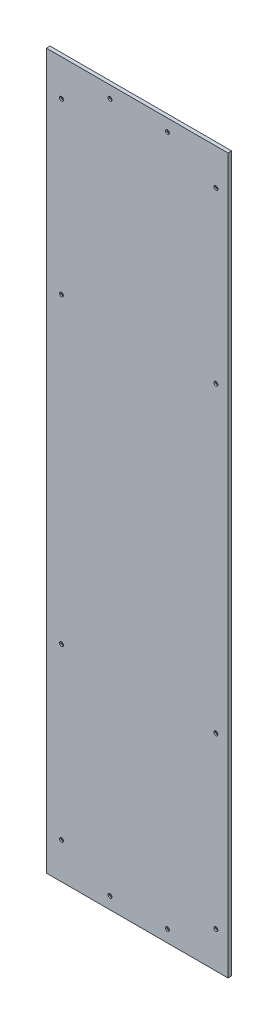
ISO-10303-21;
HEADER;
FILE_DESCRIPTION(('STEP AP214'),'2;1');
FILE_NAME('part.step','',(''),(''),'','','');
FILE_SCHEMA(('AUTOMOTIVE_DESIGN { 1 0 10303 214 1 1 1 1 }'));
ENDSEC;
DATA;
#1=APPLICATION_CONTEXT('core data for automotive mechanical design processes');
#2=APPLICATION_PROTOCOL_DEFINITION('international standard','automotive_design',2000,#1);
#3=PRODUCT_CONTEXT('',#1,'mechanical');
#4=PRODUCT('Part','Part','',(#3));
#5=PRODUCT_RELATED_PRODUCT_CATEGORY('part','',(#4));
#6=PRODUCT_DEFINITION_FORMATION('','',#4);
#7=PRODUCT_DEFINITION_CONTEXT('part definition',#1,'design');
#8=PRODUCT_DEFINITION('design','',#6,#7);
#9=PRODUCT_DEFINITION_SHAPE('','',#8);
#10=(LENGTH_UNIT() NAMED_UNIT(*) SI_UNIT(.MILLI.,.METRE.));
#11=(NAMED_UNIT(*) PLANE_ANGLE_UNIT() SI_UNIT($,.RADIAN.));
#12=(NAMED_UNIT(*) SI_UNIT($,.STERADIAN.) SOLID_ANGLE_UNIT());
#13=UNCERTAINTY_MEASURE_WITH_UNIT(LENGTH_MEASURE(1.E-05),#10,'distance_accuracy_value','');
#14=(GEOMETRIC_REPRESENTATION_CONTEXT(3) GLOBAL_UNCERTAINTY_ASSIGNED_CONTEXT((#13)) GLOBAL_UNIT_ASSIGNED_CONTEXT((#10,
#11,#12)) REPRESENTATION_CONTEXT('',''));
#15=CARTESIAN_POINT('',(0.,0.,0.));
#16=DIRECTION('',(0.,0.,1.));
#17=DIRECTION('',(1.,0.,0.));
#18=AXIS2_PLACEMENT_3D('',#15,#16,#17);
#19=CARTESIAN_POINT('',(0.,0.,-3.));
#20=DIRECTION('',(0.,0.,1.));
#21=DIRECTION('',(1.,0.,0.));
#22=AXIS2_PLACEMENT_3D('',#19,#20,#21);
#23=PLANE('',#22);
#24=CARTESIAN_POINT('',(105.,1160.,-2.9999999999859));
#25=DIRECTION('',(0.,0.,-1.));
#26=DIRECTION('',(-1.,0.,0.));
#27=AXIS2_PLACEMENT_3D('',#24,#25,#26);
#28=CIRCLE('',#27,6.85499999995499);
#29=CARTESIAN_POINT('',(98.145000000045,1160.,-2.9999999999859));
#30=VERTEX_POINT('',#29);
#31=EDGE_CURVE('E69',#30,#30,#28,.F.);
#32=ORIENTED_EDGE('',*,*,#31,.T.);
#33=EDGE_LOOP('',(#32));
#34=FACE_BOUND('',#33,.T.);
#35=CARTESIAN_POINT('',(200.,1160.,-3.00000000004275));
#36=DIRECTION('',(0.,0.,-1.));
#37=DIRECTION('',(0.,1.,0.));
#38=AXIS2_PLACEMENT_3D('',#35,#36,#37);
#39=CIRCLE('',#38,6.85500000004141);
#40=CARTESIAN_POINT('',(200.,1166.85500000004,-3.00000000004275));
#41=VERTEX_POINT('',#40);
#42=EDGE_CURVE('E117',#41,#41,#39,.F.);
#43=ORIENTED_EDGE('',*,*,#42,.T.);
#44=EDGE_LOOP('',(#43));
#45=FACE_BOUND('',#44,.T.);
#46=CARTESIAN_POINT('',(25.,1120.,-2.9999999999859));
#47=DIRECTION('',(0.,0.,-1.));
#48=DIRECTION('',(-1.,0.,0.));
#49=AXIS2_PLACEMENT_3D('',#46,#47,#48);
#50=CIRCLE('',#49,6.85499999993908);
#51=CARTESIAN_POINT('',(18.1450000000609,1120.,-2.9999999999859));
#52=VERTEX_POINT('',#51);
#53=EDGE_CURVE('E120',#52,#52,#50,.F.);
#54=ORIENTED_EDGE('',*,*,#53,.T.);
#55=EDGE_LOOP('',(#54));
#56=FACE_BOUND('',#55,.T.);
#57=CARTESIAN_POINT('',(25.,60.,-2.9999999999859));
#58=DIRECTION('',(0.,0.,-1.));
#59=DIRECTION('',(-1.,0.,0.));
#60=AXIS2_PLACEMENT_3D('',#57,#58,#59);
#61=CIRCLE('',#60,6.85499999993908);
#62=CARTESIAN_POINT('',(18.1450000000609,60.,-2.9999999999859));
#63=VERTEX_POINT('',#62);
#64=EDGE_CURVE('E123',#63,#63,#61,.F.);
#65=ORIENTED_EDGE('',*,*,#64,.T.);
#66=EDGE_LOOP('',(#65));
#67=FACE_BOUND('',#66,.T.);
#68=CARTESIAN_POINT('',(25.,840.,-2.9999999999859));
#69=DIRECTION('',(0.,0.,-1.));
#70=DIRECTION('',(-1.,0.,0.));
#71=AXIS2_PLACEMENT_3D('',#68,#69,#70);
#72=CIRCLE('',#71,6.85499999993908);
#73=CARTESIAN_POINT('',(18.1450000000609,840.,-2.9999999999859));
#74=VERTEX_POINT('',#73);
#75=EDGE_CURVE('E126',#74,#74,#72,.F.);
#76=ORIENTED_EDGE('',*,*,#75,.T.);
#77=EDGE_LOOP('',(#76));
#78=FACE_BOUND('',#77,.T.);
#79=CARTESIAN_POINT('',(25.,340.,-2.9999999999859));
#80=DIRECTION('',(0.,0.,-1.));
#81=DIRECTION('',(-1.,0.,0.));
#82=AXIS2_PLACEMENT_3D('',#79,#80,#81);
#83=CIRCLE('',#82,6.85499999993908);
#84=CARTESIAN_POINT('',(18.1450000000609,340.,-2.9999999999859));
#85=VERTEX_POINT('',#84);
#86=EDGE_CURVE('E129',#85,#85,#83,.F.);
#87=ORIENTED_EDGE('',*,*,#86,.T.);
#88=EDGE_LOOP('',(#87));
#89=FACE_BOUND('',#88,.T.);
#90=CARTESIAN_POINT('',(280.,1120.,-2.9999999999859));
#91=DIRECTION('',(0.,0.,-1.));
#92=DIRECTION('',(0.,1.,0.));
#93=AXIS2_PLACEMENT_3D('',#90,#91,#92);
#94=CIRCLE('',#93,6.85500000005734);
#95=CARTESIAN_POINT('',(280.,1126.85500000006,-2.9999999999859));
#96=VERTEX_POINT('',#95);
#97=EDGE_CURVE('E132',#96,#96,#94,.F.);
#98=ORIENTED_EDGE('',*,*,#97,.T.);
#99=EDGE_LOOP('',(#98));
#100=FACE_BOUND('',#99,.T.);
#101=CARTESIAN_POINT('',(280.,60.,-2.9999999999859));
#102=DIRECTION('',(0.,0.,-1.));
#103=DIRECTION('',(0.,1.,0.));
#104=AXIS2_PLACEMENT_3D('',#101,#102,#103);
#105=CIRCLE('',#104,6.85500000005734);
#106=CARTESIAN_POINT('',(280.,66.8550000000573,-2.9999999999859));
#107=VERTEX_POINT('',#106);
#108=EDGE_CURVE('E135',#107,#107,#105,.F.);
#109=ORIENTED_EDGE('',*,*,#108,.T.);
#110=EDGE_LOOP('',(#109));
#111=FACE_BOUND('',#110,.T.);
#112=CARTESIAN_POINT('',(280.,840.,-2.9999999999859));
#113=DIRECTION('',(0.,0.,-1.));
#114=DIRECTION('',(0.,1.,0.));
#115=AXIS2_PLACEMENT_3D('',#112,#113,#114);
#116=CIRCLE('',#115,6.85500000005734);
#117=CARTESIAN_POINT('',(280.,846.855000000057,-2.9999999999859));
#118=VERTEX_POINT('',#117);
#119=EDGE_CURVE('E138',#118,#118,#116,.F.);
#120=ORIENTED_EDGE('',*,*,#119,.T.);
#121=EDGE_LOOP('',(#120));
#122=FACE_BOUND('',#121,.T.);
#123=CARTESIAN_POINT('',(280.,340.,-2.9999999999859));
#124=DIRECTION('',(0.,0.,-1.));
#125=DIRECTION('',(0.,1.,0.));
#126=AXIS2_PLACEMENT_3D('',#123,#124,#125);
#127=CIRCLE('',#126,6.85500000005734);
#128=CARTESIAN_POINT('',(280.,346.855000000057,-2.9999999999859));
#129=VERTEX_POINT('',#128);
#130=EDGE_CURVE('E141',#129,#129,#127,.F.);
#131=ORIENTED_EDGE('',*,*,#130,.T.);
#132=EDGE_LOOP('',(#131));
#133=FACE_BOUND('',#132,.T.);
#134=CARTESIAN_POINT('',(105.,20.,-2.9999999999859));
#135=DIRECTION('',(0.,0.,-1.));
#136=DIRECTION('',(-1.,0.,0.));
#137=AXIS2_PLACEMENT_3D('',#134,#135,#136);
#138=CIRCLE('',#137,6.85499999995499);
#139=CARTESIAN_POINT('',(98.145000000045,20.,-2.9999999999859));
#140=VERTEX_POINT('',#139);
#141=EDGE_CURVE('E143',#140,#140,#138,.F.);
#142=ORIENTED_EDGE('',*,*,#141,.T.);
#143=EDGE_LOOP('',(#142));
#144=FACE_BOUND('',#143,.T.);
#145=CARTESIAN_POINT('',(200.,20.,-3.00000000004275));
#146=DIRECTION('',(0.,0.,-1.));
#147=DIRECTION('',(0.,1.,0.));
#148=AXIS2_PLACEMENT_3D('',#145,#146,#147);
#149=CIRCLE('',#148,6.85500000004141);
#150=CARTESIAN_POINT('',(200.,26.8550000000414,-3.00000000004275));
#151=VERTEX_POINT('',#150);
#152=EDGE_CURVE('E20',#151,#151,#149,.F.);
#153=ORIENTED_EDGE('',*,*,#152,.T.);
#154=EDGE_LOOP('',(#153));
#155=FACE_BOUND('',#154,.T.);
#156=DIRECTION('',(1.,0.,0.));
#157=VECTOR('',#156,1.);
#158=CARTESIAN_POINT('',(300.,1180.,-3.));
#159=LINE('',#158,#157);
#160=CARTESIAN_POINT('',(300.,1180.,-3.));
#161=VERTEX_POINT('',#160);
#162=CARTESIAN_POINT('',(0.,1180.,-3.));
#163=VERTEX_POINT('',#162);
#164=EDGE_CURVE('E160',#161,#163,#159,.F.);
#165=ORIENTED_EDGE('',*,*,#164,.F.);
#166=DIRECTION('',(0.,1.,0.));
#167=VECTOR('',#166,1.);
#168=CARTESIAN_POINT('',(300.,0.,-3.));
#169=LINE('',#168,#167);
#170=CARTESIAN_POINT('',(300.,0.,-3.));
#171=VERTEX_POINT('',#170);
#172=EDGE_CURVE('E71',#171,#161,#169,.T.);
#173=ORIENTED_EDGE('',*,*,#172,.F.);
#174=DIRECTION('',(1.,0.,0.));
#175=VECTOR('',#174,1.);
#176=CARTESIAN_POINT('',(0.,0.,-3.));
#177=LINE('',#176,#175);
#178=CARTESIAN_POINT('',(0.,0.,-3.));
#179=VERTEX_POINT('',#178);
#180=EDGE_CURVE('E55',#179,#171,#177,.T.);
#181=ORIENTED_EDGE('',*,*,#180,.F.);
#182=DIRECTION('',(0.,1.,0.));
#183=VECTOR('',#182,1.);
#184=CARTESIAN_POINT('',(0.,1180.,-3.));
#185=LINE('',#184,#183);
#186=EDGE_CURVE('E60',#163,#179,#185,.F.);
#187=ORIENTED_EDGE('',*,*,#186,.F.);
#188=EDGE_LOOP('',(#165,#173,#181,#187));
#189=FACE_BOUND('',#188,.T.);
#190=ADVANCED_FACE('F17',(#34,#45,#56,#67,#78,#89,#100,#111,#122,#133,#144,#155,#189),#23,.F.);
#191=CARTESIAN_POINT('',(200.,20.,-3.00000000004275));
#192=DIRECTION('',(0.,0.,-1.));
#193=DIRECTION('',(0.,1.,0.));
#194=AXIS2_PLACEMENT_3D('',#191,#192,#193);
#195=CONICAL_SURFACE('',#194,6.85500000004141,0.785397999990634);
#196=ORIENTED_EDGE('',*,*,#152,.F.);
#197=EDGE_LOOP('',(#196));
#198=FACE_BOUND('',#197,.T.);
#199=CARTESIAN_POINT('',(200.,20.,0.555001161756055));
#200=DIRECTION('',(0.,0.,-1.));
#201=DIRECTION('',(-1.,0.,0.));
#202=AXIS2_PLACEMENT_3D('',#199,#200,#201);
#203=CIRCLE('',#202,3.3);
#204=CARTESIAN_POINT('',(196.7,20.,0.555001161756055));
#205=VERTEX_POINT('',#204);
#206=EDGE_CURVE('E157',#205,#205,#203,.F.);
#207=ORIENTED_EDGE('',*,*,#206,.T.);
#208=EDGE_LOOP('',(#207));
#209=FACE_BOUND('',#208,.T.);
#210=ADVANCED_FACE('F151',(#198,#209),#195,.F.);
#211=CARTESIAN_POINT('',(105.,20.,-2.99999999992906));
#212=DIRECTION('',(0.,0.,-1.));
#213=DIRECTION('',(-1.,0.,0.));
#214=AXIS2_PLACEMENT_3D('',#211,#212,#213);
#215=CONICAL_SURFACE('',#214,6.85499999989815,0.785397999990634);
#216=ORIENTED_EDGE('',*,*,#141,.F.);
#217=EDGE_LOOP('',(#216));
#218=FACE_BOUND('',#217,.T.);
#219=CARTESIAN_POINT('',(105.,20.,0.555001161756055));
#220=DIRECTION('',(0.,0.,-1.));
#221=DIRECTION('',(-1.,0.,0.));
#222=AXIS2_PLACEMENT_3D('',#219,#220,#221);
#223=CIRCLE('',#222,3.29999999999998);
#224=CARTESIAN_POINT('',(101.7,20.,0.555001161756055));
#225=VERTEX_POINT('',#224);
#226=EDGE_CURVE('E159',#225,#225,#223,.F.);
#227=ORIENTED_EDGE('',*,*,#226,.T.);
#228=EDGE_LOOP('',(#227));
#229=FACE_BOUND('',#228,.T.);
#230=ADVANCED_FACE('F154',(#218,#229),#215,.F.);
#231=CARTESIAN_POINT('',(280.,340.,-2.99999999987222));
#232=DIRECTION('',(0.,0.,-1.));
#233=DIRECTION('',(0.,1.,0.));
#234=AXIS2_PLACEMENT_3D('',#231,#232,#233);
#235=CONICAL_SURFACE('',#234,6.85499999994366,0.785398000006624);
#236=ORIENTED_EDGE('',*,*,#130,.F.);
#237=EDGE_LOOP('',(#236));
#238=FACE_BOUND('',#237,.T.);
#239=CARTESIAN_POINT('',(280.,340.,0.555001161756055));
#240=DIRECTION('',(0.,0.,-1.));
#241=DIRECTION('',(-1.,0.,0.));
#242=AXIS2_PLACEMENT_3D('',#239,#240,#241);
#243=CIRCLE('',#242,3.29999999999997);
#244=CARTESIAN_POINT('',(276.7,340.,0.555001161756055));
#245=VERTEX_POINT('',#244);
#246=EDGE_CURVE('E163',#245,#245,#243,.F.);
#247=ORIENTED_EDGE('',*,*,#246,.T.);
#248=EDGE_LOOP('',(#247));
#249=FACE_BOUND('',#248,.T.);
#250=ADVANCED_FACE('F235',(#238,#249),#235,.F.);
#251=CARTESIAN_POINT('',(280.,840.,-2.99999999987222));
#252=DIRECTION('',(0.,0.,-1.));
#253=DIRECTION('',(0.,1.,0.));
#254=AXIS2_PLACEMENT_3D('',#251,#252,#253);
#255=CONICAL_SURFACE('',#254,6.85499999994366,0.785398000006624);
#256=ORIENTED_EDGE('',*,*,#119,.F.);
#257=EDGE_LOOP('',(#256));
#258=FACE_BOUND('',#257,.T.);
#259=CARTESIAN_POINT('',(280.,840.,0.555001161756055));
#260=DIRECTION('',(0.,0.,-1.));
#261=DIRECTION('',(-1.,0.,0.));
#262=AXIS2_PLACEMENT_3D('',#259,#260,#261);
#263=CIRCLE('',#262,3.29999999999997);
#264=CARTESIAN_POINT('',(276.7,840.,0.555001161756055));
#265=VERTEX_POINT('',#264);
#266=EDGE_CURVE('E223',#265,#265,#263,.F.);
#267=ORIENTED_EDGE('',*,*,#266,.T.);
#268=EDGE_LOOP('',(#267));
#269=FACE_BOUND('',#268,.T.);
#270=ADVANCED_FACE('F305',(#258,#269),#255,.F.);
#271=CARTESIAN_POINT('',(280.,60.,-2.99999999987222));
#272=DIRECTION('',(0.,0.,-1.));
#273=DIRECTION('',(0.,1.,0.));
#274=AXIS2_PLACEMENT_3D('',#271,#272,#273);
#275=CONICAL_SURFACE('',#274,6.85499999994366,0.785398000006624);
#276=ORIENTED_EDGE('',*,*,#108,.F.);
#277=EDGE_LOOP('',(#276));
#278=FACE_BOUND('',#277,.T.);
#279=CARTESIAN_POINT('',(280.,60.,0.555001161756055));
#280=DIRECTION('',(0.,0.,-1.));
#281=DIRECTION('',(-1.,0.,0.));
#282=AXIS2_PLACEMENT_3D('',#279,#280,#281);
#283=CIRCLE('',#282,3.29999999999997);
#284=CARTESIAN_POINT('',(276.7,60.,0.555001161756055));
#285=VERTEX_POINT('',#284);
#286=EDGE_CURVE('E218',#285,#285,#283,.F.);
#287=ORIENTED_EDGE('',*,*,#286,.T.);
#288=EDGE_LOOP('',(#287));
#289=FACE_BOUND('',#288,.T.);
#290=ADVANCED_FACE('F301',(#278,#289),#275,.F.);
#291=CARTESIAN_POINT('',(280.,1120.,-2.99999999987222));
#292=DIRECTION('',(0.,0.,-1.));
#293=DIRECTION('',(0.,1.,0.));
#294=AXIS2_PLACEMENT_3D('',#291,#292,#293);
#295=CONICAL_SURFACE('',#294,6.85499999994366,0.785398000006624);
#296=ORIENTED_EDGE('',*,*,#97,.F.);
#297=EDGE_LOOP('',(#296));
#298=FACE_BOUND('',#297,.T.);
#299=CARTESIAN_POINT('',(280.,1120.,0.555001161756055));
#300=DIRECTION('',(0.,0.,-1.));
#301=DIRECTION('',(-1.,0.,0.));
#302=AXIS2_PLACEMENT_3D('',#299,#300,#301);
#303=CIRCLE('',#302,3.29999999999997);
#304=CARTESIAN_POINT('',(276.7,1120.,0.555001161756055));
#305=VERTEX_POINT('',#304);
#306=EDGE_CURVE('E213',#305,#305,#303,.F.);
#307=ORIENTED_EDGE('',*,*,#306,.T.);
#308=EDGE_LOOP('',(#307));
#309=FACE_BOUND('',#308,.T.);
#310=ADVANCED_FACE('F297',(#298,#309),#295,.F.);
#311=CARTESIAN_POINT('',(25.,340.,-2.99999999992906));
#312=DIRECTION('',(0.,0.,-1.));
#313=DIRECTION('',(-1.,0.,0.));
#314=AXIS2_PLACEMENT_3D('',#311,#312,#313);
#315=CONICAL_SURFACE('',#314,6.85499999988224,0.785397999990634);
#316=ORIENTED_EDGE('',*,*,#86,.F.);
#317=EDGE_LOOP('',(#316));
#318=FACE_BOUND('',#317,.T.);
#319=CARTESIAN_POINT('',(25.,340.,0.555001161756055));
#320=DIRECTION('',(0.,0.,-1.));
#321=DIRECTION('',(-1.,0.,0.));
#322=AXIS2_PLACEMENT_3D('',#319,#320,#321);
#323=CIRCLE('',#322,3.29999999999999);
#324=CARTESIAN_POINT('',(21.7,340.,0.555001161756055));
#325=VERTEX_POINT('',#324);
#326=EDGE_CURVE('E208',#325,#325,#323,.F.);
#327=ORIENTED_EDGE('',*,*,#326,.T.);
#328=EDGE_LOOP('',(#327));
#329=FACE_BOUND('',#328,.T.);
#330=ADVANCED_FACE('F293',(#318,#329),#315,.F.);
#331=CARTESIAN_POINT('',(25.,840.,-2.99999999992906));
#332=DIRECTION('',(0.,0.,-1.));
#333=DIRECTION('',(-1.,0.,0.));
#334=AXIS2_PLACEMENT_3D('',#331,#332,#333);
#335=CONICAL_SURFACE('',#334,6.85499999988224,0.785397999990634);
#336=ORIENTED_EDGE('',*,*,#75,.F.);
#337=EDGE_LOOP('',(#336));
#338=FACE_BOUND('',#337,.T.);
#339=CARTESIAN_POINT('',(25.,840.,0.555001161756055));
#340=DIRECTION('',(0.,0.,-1.));
#341=DIRECTION('',(-1.,0.,0.));
#342=AXIS2_PLACEMENT_3D('',#339,#340,#341);
#343=CIRCLE('',#342,3.29999999999999);
#344=CARTESIAN_POINT('',(21.7,840.,0.555001161756055));
#345=VERTEX_POINT('',#344);
#346=EDGE_CURVE('E203',#345,#345,#343,.F.);
#347=ORIENTED_EDGE('',*,*,#346,.T.);
#348=EDGE_LOOP('',(#347));
#349=FACE_BOUND('',#348,.T.);
#350=ADVANCED_FACE('F289',(#338,#349),#335,.F.);
#351=CARTESIAN_POINT('',(25.,60.,-2.99999999992906));
#352=DIRECTION('',(0.,0.,-1.));
#353=DIRECTION('',(-1.,0.,0.));
#354=AXIS2_PLACEMENT_3D('',#351,#352,#353);
#355=CONICAL_SURFACE('',#354,6.85499999988224,0.785397999990634);
#356=ORIENTED_EDGE('',*,*,#64,.F.);
#357=EDGE_LOOP('',(#356));
#358=FACE_BOUND('',#357,.T.);
#359=CARTESIAN_POINT('',(25.,60.,0.555001161756055));
#360=DIRECTION('',(0.,0.,-1.));
#361=DIRECTION('',(-1.,0.,0.));
#362=AXIS2_PLACEMENT_3D('',#359,#360,#361);
#363=CIRCLE('',#362,3.29999999999999);
#364=CARTESIAN_POINT('',(21.7,60.,0.555001161756055));
#365=VERTEX_POINT('',#364);
#366=EDGE_CURVE('E198',#365,#365,#363,.F.);
#367=ORIENTED_EDGE('',*,*,#366,.T.);
#368=EDGE_LOOP('',(#367));
#369=FACE_BOUND('',#368,.T.);
#370=ADVANCED_FACE('F285',(#358,#369),#355,.F.);
#371=CARTESIAN_POINT('',(25.,1120.,-2.99999999992906));
#372=DIRECTION('',(0.,0.,-1.));
#373=DIRECTION('',(-1.,0.,0.));
#374=AXIS2_PLACEMENT_3D('',#371,#372,#373);
#375=CONICAL_SURFACE('',#374,6.85499999988224,0.785397999990634);
#376=ORIENTED_EDGE('',*,*,#53,.F.);
#377=EDGE_LOOP('',(#376));
#378=FACE_BOUND('',#377,.T.);
#379=CARTESIAN_POINT('',(25.,1120.,0.555001161756055));
#380=DIRECTION('',(0.,0.,-1.));
#381=DIRECTION('',(-1.,0.,0.));
#382=AXIS2_PLACEMENT_3D('',#379,#380,#381);
#383=CIRCLE('',#382,3.29999999999999);
#384=CARTESIAN_POINT('',(21.7,1120.,0.555001161756055));
#385=VERTEX_POINT('',#384);
#386=EDGE_CURVE('E193',#385,#385,#383,.F.);
#387=ORIENTED_EDGE('',*,*,#386,.T.);
#388=EDGE_LOOP('',(#387));
#389=FACE_BOUND('',#388,.T.);
#390=ADVANCED_FACE('F281',(#378,#389),#375,.F.);
#391=CARTESIAN_POINT('',(200.,1160.,-3.00000000004275));
#392=DIRECTION('',(0.,0.,-1.));
#393=DIRECTION('',(0.,1.,0.));
#394=AXIS2_PLACEMENT_3D('',#391,#392,#393);
#395=CONICAL_SURFACE('',#394,6.85500000004141,0.785397999990634);
#396=ORIENTED_EDGE('',*,*,#42,.F.);
#397=EDGE_LOOP('',(#396));
#398=FACE_BOUND('',#397,.T.);
#399=CARTESIAN_POINT('',(200.,1160.,0.555001161756055));
#400=DIRECTION('',(0.,0.,-1.));
#401=DIRECTION('',(-1.,0.,0.));
#402=AXIS2_PLACEMENT_3D('',#399,#400,#401);
#403=CIRCLE('',#402,3.3);
#404=CARTESIAN_POINT('',(196.7,1160.,0.555001161756055));
#405=VERTEX_POINT('',#404);
#406=EDGE_CURVE('E188',#405,#405,#403,.F.);
#407=ORIENTED_EDGE('',*,*,#406,.T.);
#408=EDGE_LOOP('',(#407));
#409=FACE_BOUND('',#408,.T.);
#410=ADVANCED_FACE('F277',(#398,#409),#395,.F.);
#411=CARTESIAN_POINT('',(105.,1160.,-2.99999999992906));
#412=DIRECTION('',(0.,0.,-1.));
#413=DIRECTION('',(-1.,0.,0.));
#414=AXIS2_PLACEMENT_3D('',#411,#412,#413);
#415=CONICAL_SURFACE('',#414,6.85499999989815,0.785397999990634);
#416=ORIENTED_EDGE('',*,*,#31,.F.);
#417=EDGE_LOOP('',(#416));
#418=FACE_BOUND('',#417,.T.);
#419=CARTESIAN_POINT('',(105.,1160.,0.555001161756055));
#420=DIRECTION('',(0.,0.,-1.));
#421=DIRECTION('',(-1.,0.,0.));
#422=AXIS2_PLACEMENT_3D('',#419,#420,#421);
#423=CIRCLE('',#422,3.29999999999998);
#424=CARTESIAN_POINT('',(101.7,1160.,0.555001161756055));
#425=VERTEX_POINT('',#424);
#426=EDGE_CURVE('E182',#425,#425,#423,.F.);
#427=ORIENTED_EDGE('',*,*,#426,.T.);
#428=EDGE_LOOP('',(#427));
#429=FACE_BOUND('',#428,.T.);
#430=ADVANCED_FACE('F274',(#418,#429),#415,.F.);
#431=CARTESIAN_POINT('',(0.,1180.,-3.));
#432=DIRECTION('',(-1.,0.,0.));
#433=DIRECTION('',(0.,0.,1.));
#434=AXIS2_PLACEMENT_3D('',#431,#432,#433);
#435=PLANE('',#434);
#436=DIRECTION('',(0.,0.,1.));
#437=VECTOR('',#436,1.);
#438=CARTESIAN_POINT('',(0.,1180.,-3.));
#439=LINE('',#438,#437);
#440=CARTESIAN_POINT('',(0.,1180.,3.));
#441=VERTEX_POINT('',#440);
#442=EDGE_CURVE('E65',#163,#441,#439,.T.);
#443=ORIENTED_EDGE('',*,*,#442,.F.);
#444=ORIENTED_EDGE('',*,*,#186,.T.);
#445=DIRECTION('',(0.,0.,-1.));
#446=VECTOR('',#445,1.);
#447=CARTESIAN_POINT('',(0.,0.,-3.));
#448=LINE('',#447,#446);
#449=CARTESIAN_POINT('',(0.,0.,3.));
#450=VERTEX_POINT('',#449);
#451=EDGE_CURVE('E62',#450,#179,#448,.T.);
#452=ORIENTED_EDGE('',*,*,#451,.F.);
#453=DIRECTION('',(0.,1.,0.));
#454=VECTOR('',#453,1.);
#455=CARTESIAN_POINT('',(0.,0.,3.));
#456=LINE('',#455,#454);
#457=EDGE_CURVE('E180',#441,#450,#456,.F.);
#458=ORIENTED_EDGE('',*,*,#457,.F.);
#459=EDGE_LOOP('',(#443,#444,#452,#458));
#460=FACE_BOUND('',#459,.T.);
#461=ADVANCED_FACE('F61',(#460),#435,.T.);
#462=CARTESIAN_POINT('',(0.,0.,-3.));
#463=DIRECTION('',(0.,-1.,0.));
#464=DIRECTION('',(0.,0.,-1.));
#465=AXIS2_PLACEMENT_3D('',#462,#463,#464);
#466=PLANE('',#465);
#467=ORIENTED_EDGE('',*,*,#451,.T.);
#468=ORIENTED_EDGE('',*,*,#180,.T.);
#469=DIRECTION('',(0.,0.,-1.));
#470=VECTOR('',#469,1.);
#471=CARTESIAN_POINT('',(300.,0.,-3.));
#472=LINE('',#471,#470);
#473=CARTESIAN_POINT('',(300.,0.,3.));
#474=VERTEX_POINT('',#473);
#475=EDGE_CURVE('E73',#474,#171,#472,.T.);
#476=ORIENTED_EDGE('',*,*,#475,.F.);
#477=DIRECTION('',(1.,0.,0.));
#478=VECTOR('',#477,1.);
#479=CARTESIAN_POINT('',(0.,0.,3.));
#480=LINE('',#479,#478);
#481=EDGE_CURVE('E77',#450,#474,#480,.T.);
#482=ORIENTED_EDGE('',*,*,#481,.F.);
#483=EDGE_LOOP('',(#467,#468,#476,#482));
#484=FACE_BOUND('',#483,.T.);
#485=ADVANCED_FACE('F75',(#484),#466,.T.);
#486=CARTESIAN_POINT('',(300.,0.,-3.));
#487=DIRECTION('',(1.,0.,0.));
#488=DIRECTION('',(0.,0.,-1.));
#489=AXIS2_PLACEMENT_3D('',#486,#487,#488);
#490=PLANE('',#489);
#491=ORIENTED_EDGE('',*,*,#475,.T.);
#492=ORIENTED_EDGE('',*,*,#172,.T.);
#493=DIRECTION('',(0.,0.,1.));
#494=VECTOR('',#493,1.);
#495=CARTESIAN_POINT('',(300.,1180.,-3.));
#496=LINE('',#495,#494);
#497=CARTESIAN_POINT('',(300.,1180.,3.));
#498=VERTEX_POINT('',#497);
#499=EDGE_CURVE('E35',#498,#161,#496,.F.);
#500=ORIENTED_EDGE('',*,*,#499,.F.);
#501=DIRECTION('',(0.,1.,0.));
#502=VECTOR('',#501,1.);
#503=CARTESIAN_POINT('',(300.,0.,3.));
#504=LINE('',#503,#502);
#505=EDGE_CURVE('E175',#474,#498,#504,.T.);
#506=ORIENTED_EDGE('',*,*,#505,.F.);
#507=EDGE_LOOP('',(#491,#492,#500,#506));
#508=FACE_BOUND('',#507,.T.);
#509=ADVANCED_FACE('F173',(#508),#490,.T.);
#510=CARTESIAN_POINT('',(300.,1180.,-3.));
#511=DIRECTION('',(0.,1.,0.));
#512=DIRECTION('',(0.,0.,1.));
#513=AXIS2_PLACEMENT_3D('',#510,#511,#512);
#514=PLANE('',#513);
#515=ORIENTED_EDGE('',*,*,#499,.T.);
#516=ORIENTED_EDGE('',*,*,#164,.T.);
#517=ORIENTED_EDGE('',*,*,#442,.T.);
#518=DIRECTION('',(1.,0.,0.));
#519=VECTOR('',#518,1.);
#520=CARTESIAN_POINT('',(0.,1180.,3.));
#521=LINE('',#520,#519);
#522=EDGE_CURVE('E114',#498,#441,#521,.F.);
#523=ORIENTED_EDGE('',*,*,#522,.F.);
#524=EDGE_LOOP('',(#515,#516,#517,#523));
#525=FACE_BOUND('',#524,.T.);
#526=ADVANCED_FACE('F256',(#525),#514,.T.);
#527=CARTESIAN_POINT('',(200.,20.,-3.));
#528=DIRECTION('',(0.,0.,-1.));
#529=DIRECTION('',(-1.,0.,0.));
#530=AXIS2_PLACEMENT_3D('',#527,#528,#529);
#531=CYLINDRICAL_SURFACE('',#530,3.3);
#532=ORIENTED_EDGE('',*,*,#206,.F.);
#533=EDGE_LOOP('',(#532));
#534=FACE_BOUND('',#533,.T.);
#535=CARTESIAN_POINT('',(200.,20.,3.00000000000001));
#536=DIRECTION('',(0.,0.,-1.));
#537=DIRECTION('',(-1.,0.,0.));
#538=AXIS2_PLACEMENT_3D('',#535,#536,#537);
#539=CIRCLE('',#538,3.3);
#540=CARTESIAN_POINT('',(196.7,20.,3.00000000000001));
#541=VERTEX_POINT('',#540);
#542=EDGE_CURVE('E111',#541,#541,#539,.T.);
#543=ORIENTED_EDGE('',*,*,#542,.F.);
#544=EDGE_LOOP('',(#543));
#545=FACE_BOUND('',#544,.T.);
#546=ADVANCED_FACE('F254',(#534,#545),#531,.F.);
#547=CARTESIAN_POINT('',(105.,20.,-3.));
#548=DIRECTION('',(0.,0.,-1.));
#549=DIRECTION('',(-1.,0.,0.));
#550=AXIS2_PLACEMENT_3D('',#547,#548,#549);
#551=CYLINDRICAL_SURFACE('',#550,3.29999999999998);
#552=ORIENTED_EDGE('',*,*,#226,.F.);
#553=EDGE_LOOP('',(#552));
#554=FACE_BOUND('',#553,.T.);
#555=CARTESIAN_POINT('',(105.,20.,3.00000000000001));
#556=DIRECTION('',(0.,0.,-1.));
#557=DIRECTION('',(-1.,0.,0.));
#558=AXIS2_PLACEMENT_3D('',#555,#556,#557);
#559=CIRCLE('',#558,3.29999999999998);
#560=CARTESIAN_POINT('',(101.7,20.,3.00000000000001));
#561=VERTEX_POINT('',#560);
#562=EDGE_CURVE('E108',#561,#561,#559,.T.);
#563=ORIENTED_EDGE('',*,*,#562,.F.);
#564=EDGE_LOOP('',(#563));
#565=FACE_BOUND('',#564,.T.);
#566=ADVANCED_FACE('F241',(#554,#565),#551,.F.);
#567=CARTESIAN_POINT('',(280.,340.,-3.));
#568=DIRECTION('',(0.,0.,-1.));
#569=DIRECTION('',(-1.,0.,0.));
#570=AXIS2_PLACEMENT_3D('',#567,#568,#569);
#571=CYLINDRICAL_SURFACE('',#570,3.29999999999997);
#572=ORIENTED_EDGE('',*,*,#246,.F.);
#573=EDGE_LOOP('',(#572));
#574=FACE_BOUND('',#573,.T.);
#575=CARTESIAN_POINT('',(280.,340.,3.00000000000001));
#576=DIRECTION('',(0.,0.,-1.));
#577=DIRECTION('',(-1.,0.,0.));
#578=AXIS2_PLACEMENT_3D('',#575,#576,#577);
#579=CIRCLE('',#578,3.29999999999997);
#580=CARTESIAN_POINT('',(276.7,340.,3.00000000000001));
#581=VERTEX_POINT('',#580);
#582=EDGE_CURVE('E105',#581,#581,#579,.T.);
#583=ORIENTED_EDGE('',*,*,#582,.F.);
#584=EDGE_LOOP('',(#583));
#585=FACE_BOUND('',#584,.T.);
#586=ADVANCED_FACE('F237',(#574,#585),#571,.F.);
#587=CARTESIAN_POINT('',(280.,840.,-3.));
#588=DIRECTION('',(0.,0.,-1.));
#589=DIRECTION('',(-1.,0.,0.));
#590=AXIS2_PLACEMENT_3D('',#587,#588,#589);
#591=CYLINDRICAL_SURFACE('',#590,3.29999999999997);
#592=ORIENTED_EDGE('',*,*,#266,.F.);
#593=EDGE_LOOP('',(#592));
#594=FACE_BOUND('',#593,.T.);
#595=CARTESIAN_POINT('',(280.,840.,3.00000000000001));
#596=DIRECTION('',(0.,0.,-1.));
#597=DIRECTION('',(-1.,0.,0.));
#598=AXIS2_PLACEMENT_3D('',#595,#596,#597);
#599=CIRCLE('',#598,3.29999999999997);
#600=CARTESIAN_POINT('',(276.7,840.,3.00000000000001));
#601=VERTEX_POINT('',#600);
#602=EDGE_CURVE('E102',#601,#601,#599,.T.);
#603=ORIENTED_EDGE('',*,*,#602,.F.);
#604=EDGE_LOOP('',(#603));
#605=FACE_BOUND('',#604,.T.);
#606=ADVANCED_FACE('F240',(#594,#605),#591,.F.);
#607=CARTESIAN_POINT('',(280.,60.,-3.));
#608=DIRECTION('',(0.,0.,-1.));
#609=DIRECTION('',(-1.,0.,0.));
#610=AXIS2_PLACEMENT_3D('',#607,#608,#609);
#611=CYLINDRICAL_SURFACE('',#610,3.29999999999997);
#612=ORIENTED_EDGE('',*,*,#286,.F.);
#613=EDGE_LOOP('',(#612));
#614=FACE_BOUND('',#613,.T.);
#615=CARTESIAN_POINT('',(280.,60.,3.00000000000001));
#616=DIRECTION('',(0.,0.,-1.));
#617=DIRECTION('',(-1.,0.,0.));
#618=AXIS2_PLACEMENT_3D('',#615,#616,#617);
#619=CIRCLE('',#618,3.29999999999997);
#620=CARTESIAN_POINT('',(276.7,60.,3.00000000000001));
#621=VERTEX_POINT('',#620);
#622=EDGE_CURVE('E99',#621,#621,#619,.T.);
#623=ORIENTED_EDGE('',*,*,#622,.F.);
#624=EDGE_LOOP('',(#623));
#625=FACE_BOUND('',#624,.T.);
#626=ADVANCED_FACE('F409',(#614,#625),#611,.F.);
#627=CARTESIAN_POINT('',(280.,1120.,-3.));
#628=DIRECTION('',(0.,0.,-1.));
#629=DIRECTION('',(-1.,0.,0.));
#630=AXIS2_PLACEMENT_3D('',#627,#628,#629);
#631=CYLINDRICAL_SURFACE('',#630,3.29999999999997);
#632=ORIENTED_EDGE('',*,*,#306,.F.);
#633=EDGE_LOOP('',(#632));
#634=FACE_BOUND('',#633,.T.);
#635=CARTESIAN_POINT('',(280.,1120.,3.00000000000001));
#636=DIRECTION('',(0.,0.,-1.));
#637=DIRECTION('',(-1.,0.,0.));
#638=AXIS2_PLACEMENT_3D('',#635,#636,#637);
#639=CIRCLE('',#638,3.29999999999997);
#640=CARTESIAN_POINT('',(276.7,1120.,3.00000000000001));
#641=VERTEX_POINT('',#640);
#642=EDGE_CURVE('E96',#641,#641,#639,.T.);
#643=ORIENTED_EDGE('',*,*,#642,.F.);
#644=EDGE_LOOP('',(#643));
#645=FACE_BOUND('',#644,.T.);
#646=ADVANCED_FACE('F419',(#634,#645),#631,.F.);
#647=CARTESIAN_POINT('',(25.,340.,-3.));
#648=DIRECTION('',(0.,0.,-1.));
#649=DIRECTION('',(-1.,0.,0.));
#650=AXIS2_PLACEMENT_3D('',#647,#648,#649);
#651=CYLINDRICAL_SURFACE('',#650,3.29999999999999);
#652=ORIENTED_EDGE('',*,*,#326,.F.);
#653=EDGE_LOOP('',(#652));
#654=FACE_BOUND('',#653,.T.);
#655=CARTESIAN_POINT('',(25.,340.,3.00000000000001));
#656=DIRECTION('',(0.,0.,-1.));
#657=DIRECTION('',(-1.,0.,0.));
#658=AXIS2_PLACEMENT_3D('',#655,#656,#657);
#659=CIRCLE('',#658,3.29999999999999);
#660=CARTESIAN_POINT('',(21.7,340.,3.00000000000001));
#661=VERTEX_POINT('',#660);
#662=EDGE_CURVE('E93',#661,#661,#659,.T.);
#663=ORIENTED_EDGE('',*,*,#662,.F.);
#664=EDGE_LOOP('',(#663));
#665=FACE_BOUND('',#664,.T.);
#666=ADVANCED_FACE('F429',(#654,#665),#651,.F.);
#667=CARTESIAN_POINT('',(25.,840.,-3.));
#668=DIRECTION('',(0.,0.,-1.));
#669=DIRECTION('',(-1.,0.,0.));
#670=AXIS2_PLACEMENT_3D('',#667,#668,#669);
#671=CYLINDRICAL_SURFACE('',#670,3.29999999999999);
#672=ORIENTED_EDGE('',*,*,#346,.F.);
#673=EDGE_LOOP('',(#672));
#674=FACE_BOUND('',#673,.T.);
#675=CARTESIAN_POINT('',(25.,840.,3.00000000000001));
#676=DIRECTION('',(0.,0.,-1.));
#677=DIRECTION('',(-1.,0.,0.));
#678=AXIS2_PLACEMENT_3D('',#675,#676,#677);
#679=CIRCLE('',#678,3.29999999999999);
#680=CARTESIAN_POINT('',(21.7,840.,3.00000000000001));
#681=VERTEX_POINT('',#680);
#682=EDGE_CURVE('E90',#681,#681,#679,.T.);
#683=ORIENTED_EDGE('',*,*,#682,.F.);
#684=EDGE_LOOP('',(#683));
#685=FACE_BOUND('',#684,.T.);
#686=ADVANCED_FACE('F439',(#674,#685),#671,.F.);
#687=CARTESIAN_POINT('',(25.,60.,-3.));
#688=DIRECTION('',(0.,0.,-1.));
#689=DIRECTION('',(-1.,0.,0.));
#690=AXIS2_PLACEMENT_3D('',#687,#688,#689);
#691=CYLINDRICAL_SURFACE('',#690,3.29999999999999);
#692=ORIENTED_EDGE('',*,*,#366,.F.);
#693=EDGE_LOOP('',(#692));
#694=FACE_BOUND('',#693,.T.);
#695=CARTESIAN_POINT('',(25.,60.,3.00000000000001));
#696=DIRECTION('',(0.,0.,-1.));
#697=DIRECTION('',(-1.,0.,0.));
#698=AXIS2_PLACEMENT_3D('',#695,#696,#697);
#699=CIRCLE('',#698,3.29999999999999);
#700=CARTESIAN_POINT('',(21.7,60.,3.00000000000001));
#701=VERTEX_POINT('',#700);
#702=EDGE_CURVE('E87',#701,#701,#699,.T.);
#703=ORIENTED_EDGE('',*,*,#702,.F.);
#704=EDGE_LOOP('',(#703));
#705=FACE_BOUND('',#704,.T.);
#706=ADVANCED_FACE('F449',(#694,#705),#691,.F.);
#707=CARTESIAN_POINT('',(25.,1120.,-3.));
#708=DIRECTION('',(0.,0.,-1.));
#709=DIRECTION('',(-1.,0.,0.));
#710=AXIS2_PLACEMENT_3D('',#707,#708,#709);
#711=CYLINDRICAL_SURFACE('',#710,3.29999999999999);
#712=ORIENTED_EDGE('',*,*,#386,.F.);
#713=EDGE_LOOP('',(#712));
#714=FACE_BOUND('',#713,.T.);
#715=CARTESIAN_POINT('',(25.,1120.,3.00000000000001));
#716=DIRECTION('',(0.,0.,-1.));
#717=DIRECTION('',(-1.,0.,0.));
#718=AXIS2_PLACEMENT_3D('',#715,#716,#717);
#719=CIRCLE('',#718,3.29999999999999);
#720=CARTESIAN_POINT('',(21.7,1120.,3.00000000000001));
#721=VERTEX_POINT('',#720);
#722=EDGE_CURVE('E84',#721,#721,#719,.T.);
#723=ORIENTED_EDGE('',*,*,#722,.F.);
#724=EDGE_LOOP('',(#723));
#725=FACE_BOUND('',#724,.T.);
#726=ADVANCED_FACE('F459',(#714,#725),#711,.F.);
#727=CARTESIAN_POINT('',(200.,1160.,-3.));
#728=DIRECTION('',(0.,0.,-1.));
#729=DIRECTION('',(-1.,0.,0.));
#730=AXIS2_PLACEMENT_3D('',#727,#728,#729);
#731=CYLINDRICAL_SURFACE('',#730,3.3);
#732=ORIENTED_EDGE('',*,*,#406,.F.);
#733=EDGE_LOOP('',(#732));
#734=FACE_BOUND('',#733,.T.);
#735=CARTESIAN_POINT('',(200.,1160.,3.00000000000001));
#736=DIRECTION('',(0.,0.,-1.));
#737=DIRECTION('',(-1.,0.,0.));
#738=AXIS2_PLACEMENT_3D('',#735,#736,#737);
#739=CIRCLE('',#738,3.3);
#740=CARTESIAN_POINT('',(196.7,1160.,3.00000000000001));
#741=VERTEX_POINT('',#740);
#742=EDGE_CURVE('E26',#741,#741,#739,.T.);
#743=ORIENTED_EDGE('',*,*,#742,.F.);
#744=EDGE_LOOP('',(#743));
#745=FACE_BOUND('',#744,.T.);
#746=ADVANCED_FACE('F469',(#734,#745),#731,.F.);
#747=CARTESIAN_POINT('',(105.,1160.,-3.));
#748=DIRECTION('',(0.,0.,-1.));
#749=DIRECTION('',(-1.,0.,0.));
#750=AXIS2_PLACEMENT_3D('',#747,#748,#749);
#751=CYLINDRICAL_SURFACE('',#750,3.29999999999998);
#752=ORIENTED_EDGE('',*,*,#426,.F.);
#753=EDGE_LOOP('',(#752));
#754=FACE_BOUND('',#753,.T.);
#755=CARTESIAN_POINT('',(105.,1160.,3.00000000000001));
#756=DIRECTION('',(0.,0.,-1.));
#757=DIRECTION('',(-1.,0.,0.));
#758=AXIS2_PLACEMENT_3D('',#755,#756,#757);
#759=CIRCLE('',#758,3.29999999999998);
#760=CARTESIAN_POINT('',(101.7,1160.,3.00000000000001));
#761=VERTEX_POINT('',#760);
#762=EDGE_CURVE('E11',#761,#761,#759,.T.);
#763=ORIENTED_EDGE('',*,*,#762,.F.);
#764=EDGE_LOOP('',(#763));
#765=FACE_BOUND('',#764,.T.);
#766=ADVANCED_FACE('F247',(#754,#765),#751,.F.);
#767=CARTESIAN_POINT('',(0.,0.,3.));
#768=DIRECTION('',(0.,0.,1.));
#769=DIRECTION('',(1.,0.,0.));
#770=AXIS2_PLACEMENT_3D('',#767,#768,#769);
#771=PLANE('',#770);
#772=ORIENTED_EDGE('',*,*,#762,.T.);
#773=EDGE_LOOP('',(#772));
#774=FACE_BOUND('',#773,.T.);
#775=ORIENTED_EDGE('',*,*,#742,.T.);
#776=EDGE_LOOP('',(#775));
#777=FACE_BOUND('',#776,.T.);
#778=ORIENTED_EDGE('',*,*,#722,.T.);
#779=EDGE_LOOP('',(#778));
#780=FACE_BOUND('',#779,.T.);
#781=ORIENTED_EDGE('',*,*,#702,.T.);
#782=EDGE_LOOP('',(#781));
#783=FACE_BOUND('',#782,.T.);
#784=ORIENTED_EDGE('',*,*,#682,.T.);
#785=EDGE_LOOP('',(#784));
#786=FACE_BOUND('',#785,.T.);
#787=ORIENTED_EDGE('',*,*,#662,.T.);
#788=EDGE_LOOP('',(#787));
#789=FACE_BOUND('',#788,.T.);
#790=ORIENTED_EDGE('',*,*,#642,.T.);
#791=EDGE_LOOP('',(#790));
#792=FACE_BOUND('',#791,.T.);
#793=ORIENTED_EDGE('',*,*,#622,.T.);
#794=EDGE_LOOP('',(#793));
#795=FACE_BOUND('',#794,.T.);
#796=ORIENTED_EDGE('',*,*,#602,.T.);
#797=EDGE_LOOP('',(#796));
#798=FACE_BOUND('',#797,.T.);
#799=ORIENTED_EDGE('',*,*,#582,.T.);
#800=EDGE_LOOP('',(#799));
#801=FACE_BOUND('',#800,.T.);
#802=ORIENTED_EDGE('',*,*,#562,.T.);
#803=EDGE_LOOP('',(#802));
#804=FACE_BOUND('',#803,.T.);
#805=ORIENTED_EDGE('',*,*,#542,.T.);
#806=EDGE_LOOP('',(#805));
#807=FACE_BOUND('',#806,.T.);
#808=ORIENTED_EDGE('',*,*,#505,.T.);
#809=ORIENTED_EDGE('',*,*,#522,.T.);
#810=ORIENTED_EDGE('',*,*,#457,.T.);
#811=ORIENTED_EDGE('',*,*,#481,.T.);
#812=EDGE_LOOP('',(#808,#809,#810,#811));
#813=FACE_BOUND('',#812,.T.);
#814=ADVANCED_FACE('F179',(#774,#777,#780,#783,#786,#789,#792,#795,#798,#801,#804,#807,#813),
#771,.T.);
#815=CLOSED_SHELL('',(#190,#210,#230,#250,#270,#290,#310,#330,#350,#370,#390,#410,#430,#461,
#485,#509,#526,#546,#566,#586,#606,#626,#646,#666,#686,#706,#726,#746,#766,#814));
#816=MANIFOLD_SOLID_BREP('B1',#815);
#817=ADVANCED_BREP_SHAPE_REPRESENTATION('',(#18,#816),#14);
#818=SHAPE_DEFINITION_REPRESENTATION(#9,#817);
ENDSEC;
END-ISO-10303-21;
